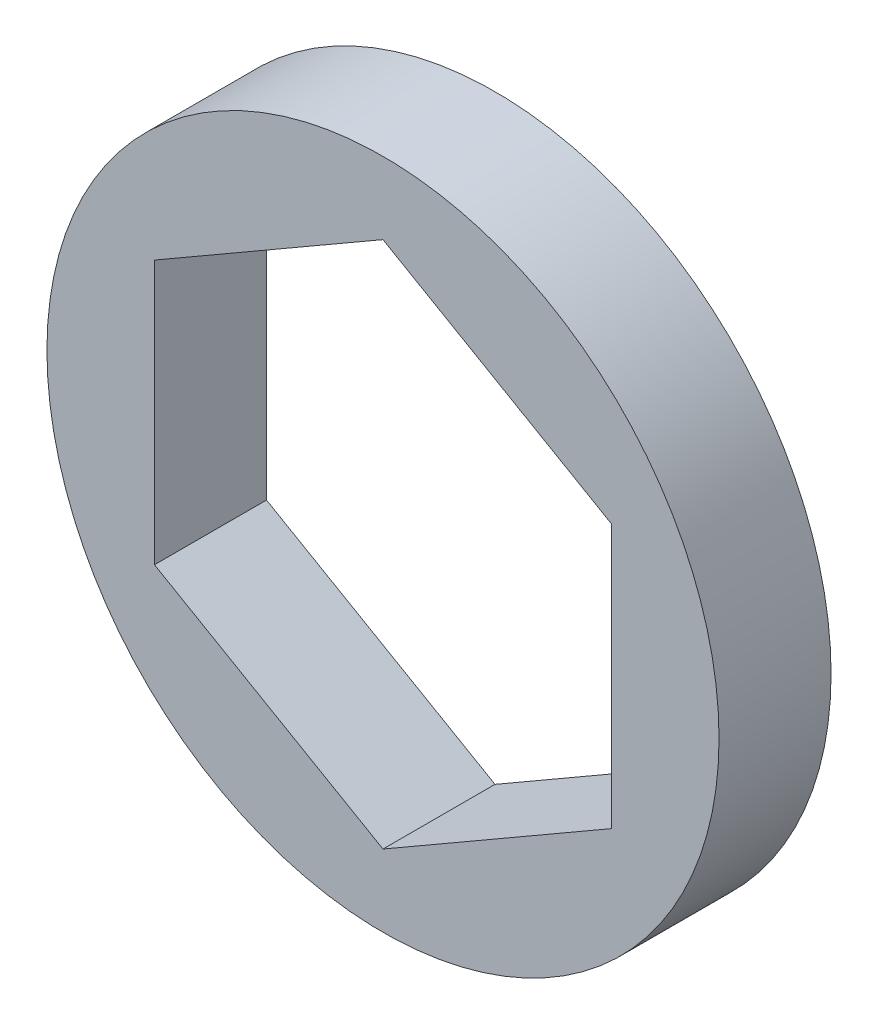
ISO-10303-21;
HEADER;
FILE_DESCRIPTION(('STEP AP214'),'2;1');
FILE_NAME('part.step','',(''),(''),'','','');
FILE_SCHEMA(('AUTOMOTIVE_DESIGN { 1 0 10303 214 1 1 1 1 }'));
ENDSEC;
DATA;
#1=APPLICATION_CONTEXT('core data for automotive mechanical design processes');
#2=APPLICATION_PROTOCOL_DEFINITION('international standard','automotive_design',2000,#1);
#3=PRODUCT_CONTEXT('',#1,'mechanical');
#4=PRODUCT('Part','Part','',(#3));
#5=PRODUCT_RELATED_PRODUCT_CATEGORY('part','',(#4));
#6=PRODUCT_DEFINITION_FORMATION('','',#4);
#7=PRODUCT_DEFINITION_CONTEXT('part definition',#1,'design');
#8=PRODUCT_DEFINITION('design','',#6,#7);
#9=PRODUCT_DEFINITION_SHAPE('','',#8);
#10=(LENGTH_UNIT() NAMED_UNIT(*) SI_UNIT(.MILLI.,.METRE.));
#11=(NAMED_UNIT(*) PLANE_ANGLE_UNIT() SI_UNIT($,.RADIAN.));
#12=(NAMED_UNIT(*) SI_UNIT($,.STERADIAN.) SOLID_ANGLE_UNIT());
#13=UNCERTAINTY_MEASURE_WITH_UNIT(LENGTH_MEASURE(1.E-05),#10,'distance_accuracy_value','');
#14=(GEOMETRIC_REPRESENTATION_CONTEXT(3) GLOBAL_UNCERTAINTY_ASSIGNED_CONTEXT((#13)) GLOBAL_UNIT_ASSIGNED_CONTEXT((#10,
#11,#12)) REPRESENTATION_CONTEXT('',''));
#15=CARTESIAN_POINT('',(0.,0.,0.));
#16=DIRECTION('',(0.,0.,1.));
#17=DIRECTION('',(1.,0.,0.));
#18=AXIS2_PLACEMENT_3D('',#15,#16,#17);
#19=CARTESIAN_POINT('',(0.,0.,-1.5875));
#20=DIRECTION('',(0.,0.,1.));
#21=DIRECTION('',(1.,0.,0.));
#22=AXIS2_PLACEMENT_3D('',#19,#20,#21);
#23=PLANE('',#22);
#24=DIRECTION('',(0.,1.,0.));
#25=VECTOR('',#24,1.);
#26=CARTESIAN_POINT('',(-6.477,3.73949769354121,-1.5875));
#27=LINE('',#26,#25);
#28=CARTESIAN_POINT('',(-6.47700000000001,-3.73949769354121,-1.5875));
#29=VERTEX_POINT('',#28);
#30=CARTESIAN_POINT('',(-6.47700000000001,3.73949769354121,-1.5875));
#31=VERTEX_POINT('',#30);
#32=EDGE_CURVE('E73',#29,#31,#27,.T.);
#33=ORIENTED_EDGE('',*,*,#32,.F.);
#34=DIRECTION('',(-0.866025403784439,0.5,0.));
#35=VECTOR('',#34,1.);
#36=CARTESIAN_POINT('',(-6.47700000000001,-3.73949769354121,-1.5875));
#37=LINE('',#36,#35);
#38=CARTESIAN_POINT('',(0.,-7.47899538708242,-1.5875));
#39=VERTEX_POINT('',#38);
#40=EDGE_CURVE('E104',#39,#29,#37,.T.);
#41=ORIENTED_EDGE('',*,*,#40,.F.);
#42=DIRECTION('',(-0.866025403784439,-0.5,0.));
#43=VECTOR('',#42,1.);
#44=CARTESIAN_POINT('',(0.,-7.47899538708242,-1.5875));
#45=LINE('',#44,#43);
#46=CARTESIAN_POINT('',(6.47700000000001,-3.73949769354122,-1.5875));
#47=VERTEX_POINT('',#46);
#48=EDGE_CURVE('E112',#47,#39,#45,.T.);
#49=ORIENTED_EDGE('',*,*,#48,.F.);
#50=DIRECTION('',(0.,-1.,0.));
#51=VECTOR('',#50,1.);
#52=CARTESIAN_POINT('',(6.47700000000001,-3.73949769354122,-1.5875));
#53=LINE('',#52,#51);
#54=CARTESIAN_POINT('',(6.47700000000001,3.73949769354121,-1.5875));
#55=VERTEX_POINT('',#54);
#56=EDGE_CURVE('E117',#55,#47,#53,.T.);
#57=ORIENTED_EDGE('',*,*,#56,.F.);
#58=DIRECTION('',(0.866025403784438,-0.5,0.));
#59=VECTOR('',#58,1.);
#60=CARTESIAN_POINT('',(6.47700000000001,3.73949769354121,-1.5875));
#61=LINE('',#60,#59);
#62=CARTESIAN_POINT('',(0.,7.47899538708242,-1.5875));
#63=VERTEX_POINT('',#62);
#64=EDGE_CURVE('E68',#63,#55,#61,.T.);
#65=ORIENTED_EDGE('',*,*,#64,.F.);
#66=DIRECTION('',(0.866025403784439,0.5,0.));
#67=VECTOR('',#66,1.);
#68=CARTESIAN_POINT('',(0.,7.47899538708242,-1.5875));
#69=LINE('',#68,#67);
#70=EDGE_CURVE('E70',#31,#63,#69,.T.);
#71=ORIENTED_EDGE('',*,*,#70,.F.);
#72=EDGE_LOOP('',(#33,#41,#49,#57,#65,#71));
#73=FACE_BOUND('',#72,.T.);
#74=CARTESIAN_POINT('',(0.,0.,-1.5875));
#75=DIRECTION('',(0.,0.,-1.));
#76=DIRECTION('',(-1.,0.,0.));
#77=AXIS2_PLACEMENT_3D('',#74,#75,#76);
#78=CIRCLE('',#77,9.525);
#79=CARTESIAN_POINT('',(-9.525,0.,-1.5875));
#80=VERTEX_POINT('',#79);
#81=EDGE_CURVE('E20',#80,#80,#78,.F.);
#82=ORIENTED_EDGE('',*,*,#81,.F.);
#83=EDGE_LOOP('',(#82));
#84=FACE_BOUND('',#83,.T.);
#85=ADVANCED_FACE('F17',(#73,#84),#23,.F.);
#86=CARTESIAN_POINT('',(0.,0.,1.5875));
#87=DIRECTION('',(0.,0.,-1.));
#88=DIRECTION('',(-1.,0.,0.));
#89=AXIS2_PLACEMENT_3D('',#86,#87,#88);
#90=CYLINDRICAL_SURFACE('',#89,9.525);
#91=ORIENTED_EDGE('',*,*,#81,.T.);
#92=EDGE_LOOP('',(#91));
#93=FACE_BOUND('',#92,.T.);
#94=CARTESIAN_POINT('',(0.,0.,1.5875));
#95=DIRECTION('',(0.,0.,-1.));
#96=DIRECTION('',(-1.,0.,0.));
#97=AXIS2_PLACEMENT_3D('',#94,#95,#96);
#98=CIRCLE('',#97,9.525);
#99=CARTESIAN_POINT('',(-9.525,0.,1.5875));
#100=VERTEX_POINT('',#99);
#101=EDGE_CURVE('E96',#100,#100,#98,.F.);
#102=ORIENTED_EDGE('',*,*,#101,.F.);
#103=EDGE_LOOP('',(#102));
#104=FACE_BOUND('',#103,.T.);
#105=ADVANCED_FACE('F155',(#93,#104),#90,.T.);
#106=CARTESIAN_POINT('',(-6.477,3.73949769354121,1.5875));
#107=DIRECTION('',(1.,0.,0.));
#108=DIRECTION('',(0.,1.,0.));
#109=AXIS2_PLACEMENT_3D('',#106,#107,#108);
#110=PLANE('',#109);
#111=DIRECTION('',(0.,1.,0.));
#112=VECTOR('',#111,1.);
#113=CARTESIAN_POINT('',(-6.47700000000001,0.,1.5875));
#114=LINE('',#113,#112);
#115=CARTESIAN_POINT('',(-6.47700000000001,-3.73949769354121,1.5875));
#116=VERTEX_POINT('',#115);
#117=CARTESIAN_POINT('',(-6.477,3.73949769354121,1.5875));
#118=VERTEX_POINT('',#117);
#119=EDGE_CURVE('E98',#116,#118,#114,.T.);
#120=ORIENTED_EDGE('',*,*,#119,.F.);
#121=DIRECTION('',(0.,0.,1.));
#122=VECTOR('',#121,1.);
#123=CARTESIAN_POINT('',(-6.47700000000001,-3.73949769354121,1.5875));
#124=LINE('',#123,#122);
#125=EDGE_CURVE('E84',#29,#116,#124,.T.);
#126=ORIENTED_EDGE('',*,*,#125,.F.);
#127=ORIENTED_EDGE('',*,*,#32,.T.);
#128=DIRECTION('',(0.,0.,1.));
#129=VECTOR('',#128,1.);
#130=CARTESIAN_POINT('',(-6.47700000000001,3.73949769354121,1.5875));
#131=LINE('',#130,#129);
#132=EDGE_CURVE('E78',#118,#31,#131,.F.);
#133=ORIENTED_EDGE('',*,*,#132,.F.);
#134=EDGE_LOOP('',(#120,#126,#127,#133));
#135=FACE_BOUND('',#134,.T.);
#136=ADVANCED_FACE('F81',(#135),#110,.T.);
#137=CARTESIAN_POINT('',(0.,7.47899538708242,1.5875));
#138=DIRECTION('',(0.5,-0.866025403784439,0.));
#139=DIRECTION('',(0.866025403784439,0.5,0.));
#140=AXIS2_PLACEMENT_3D('',#137,#138,#139);
#141=PLANE('',#140);
#142=DIRECTION('',(0.866025403784439,0.499999999999999,0.));
#143=VECTOR('',#142,1.);
#144=CARTESIAN_POINT('',(-6.477,3.73949769354121,1.5875));
#145=LINE('',#144,#143);
#146=CARTESIAN_POINT('',(0.,7.47899538708242,1.5875));
#147=VERTEX_POINT('',#146);
#148=EDGE_CURVE('E89',#118,#147,#145,.T.);
#149=ORIENTED_EDGE('',*,*,#148,.F.);
#150=ORIENTED_EDGE('',*,*,#132,.T.);
#151=ORIENTED_EDGE('',*,*,#70,.T.);
#152=DIRECTION('',(0.,0.,1.));
#153=VECTOR('',#152,1.);
#154=CARTESIAN_POINT('',(0.,7.47899538708242,1.5875));
#155=LINE('',#154,#153);
#156=EDGE_CURVE('E93',#147,#63,#155,.F.);
#157=ORIENTED_EDGE('',*,*,#156,.F.);
#158=EDGE_LOOP('',(#149,#150,#151,#157));
#159=FACE_BOUND('',#158,.T.);
#160=ADVANCED_FACE('F87',(#159),#141,.T.);
#161=CARTESIAN_POINT('',(6.47700000000001,3.73949769354121,1.5875));
#162=DIRECTION('',(-0.5,-0.866025403784438,0.));
#163=DIRECTION('',(0.866025403784438,-0.5,0.));
#164=AXIS2_PLACEMENT_3D('',#161,#162,#163);
#165=PLANE('',#164);
#166=DIRECTION('',(0.866025403784439,-0.5,0.));
#167=VECTOR('',#166,1.);
#168=CARTESIAN_POINT('',(0.,7.47899538708242,1.5875));
#169=LINE('',#168,#167);
#170=CARTESIAN_POINT('',(6.47700000000001,3.73949769354121,1.5875));
#171=VERTEX_POINT('',#170);
#172=EDGE_CURVE('E124',#147,#171,#169,.T.);
#173=ORIENTED_EDGE('',*,*,#172,.F.);
#174=ORIENTED_EDGE('',*,*,#156,.T.);
#175=ORIENTED_EDGE('',*,*,#64,.T.);
#176=DIRECTION('',(0.,0.,1.));
#177=VECTOR('',#176,1.);
#178=CARTESIAN_POINT('',(6.47700000000001,3.73949769354121,1.5875));
#179=LINE('',#178,#177);
#180=EDGE_CURVE('E114',#171,#55,#179,.F.);
#181=ORIENTED_EDGE('',*,*,#180,.F.);
#182=EDGE_LOOP('',(#173,#174,#175,#181));
#183=FACE_BOUND('',#182,.T.);
#184=ADVANCED_FACE('F122',(#183),#165,.T.);
#185=CARTESIAN_POINT('',(6.47700000000001,-3.73949769354122,1.5875));
#186=DIRECTION('',(-1.,0.,0.));
#187=DIRECTION('',(0.,-1.,0.));
#188=AXIS2_PLACEMENT_3D('',#185,#186,#187);
#189=PLANE('',#188);
#190=DIRECTION('',(0.,1.,0.));
#191=VECTOR('',#190,1.);
#192=CARTESIAN_POINT('',(6.47700000000001,0.,1.5875));
#193=LINE('',#192,#191);
#194=CARTESIAN_POINT('',(6.47700000000001,-3.73949769354122,1.5875));
#195=VERTEX_POINT('',#194);
#196=EDGE_CURVE('E128',#171,#195,#193,.F.);
#197=ORIENTED_EDGE('',*,*,#196,.F.);
#198=ORIENTED_EDGE('',*,*,#180,.T.);
#199=ORIENTED_EDGE('',*,*,#56,.T.);
#200=DIRECTION('',(0.,0.,1.));
#201=VECTOR('',#200,1.);
#202=CARTESIAN_POINT('',(6.47700000000001,-3.73949769354122,1.5875));
#203=LINE('',#202,#201);
#204=EDGE_CURVE('E109',#195,#47,#203,.F.);
#205=ORIENTED_EDGE('',*,*,#204,.F.);
#206=EDGE_LOOP('',(#197,#198,#199,#205));
#207=FACE_BOUND('',#206,.T.);
#208=ADVANCED_FACE('F136',(#207),#189,.T.);
#209=CARTESIAN_POINT('',(0.,-7.47899538708242,1.5875));
#210=DIRECTION('',(-0.5,0.866025403784439,0.));
#211=DIRECTION('',(-0.866025403784439,-0.5,0.));
#212=AXIS2_PLACEMENT_3D('',#209,#210,#211);
#213=PLANE('',#212);
#214=DIRECTION('',(-0.866025403784439,-0.5,0.));
#215=VECTOR('',#214,1.);
#216=CARTESIAN_POINT('',(6.47700000000001,-3.73949769354122,1.5875));
#217=LINE('',#216,#215);
#218=CARTESIAN_POINT('',(0.,-7.47899538708242,1.5875));
#219=VERTEX_POINT('',#218);
#220=EDGE_CURVE('E26',#195,#219,#217,.T.);
#221=ORIENTED_EDGE('',*,*,#220,.F.);
#222=ORIENTED_EDGE('',*,*,#204,.T.);
#223=ORIENTED_EDGE('',*,*,#48,.T.);
#224=DIRECTION('',(0.,0.,1.));
#225=VECTOR('',#224,1.);
#226=CARTESIAN_POINT('',(0.,-7.47899538708242,1.5875));
#227=LINE('',#226,#225);
#228=EDGE_CURVE('E35',#219,#39,#227,.F.);
#229=ORIENTED_EDGE('',*,*,#228,.F.);
#230=EDGE_LOOP('',(#221,#222,#223,#229));
#231=FACE_BOUND('',#230,.T.);
#232=ADVANCED_FACE('F134',(#231),#213,.T.);
#233=CARTESIAN_POINT('',(-6.47700000000001,-3.73949769354121,1.5875));
#234=DIRECTION('',(0.5,0.866025403784439,0.));
#235=DIRECTION('',(-0.866025403784439,0.5,0.));
#236=AXIS2_PLACEMENT_3D('',#233,#234,#235);
#237=PLANE('',#236);
#238=DIRECTION('',(-0.866025403784439,0.5,0.));
#239=VECTOR('',#238,1.);
#240=CARTESIAN_POINT('',(0.,-7.47899538708242,1.5875));
#241=LINE('',#240,#239);
#242=EDGE_CURVE('E10',#219,#116,#241,.T.);
#243=ORIENTED_EDGE('',*,*,#242,.F.);
#244=ORIENTED_EDGE('',*,*,#228,.T.);
#245=ORIENTED_EDGE('',*,*,#40,.T.);
#246=ORIENTED_EDGE('',*,*,#125,.T.);
#247=EDGE_LOOP('',(#243,#244,#245,#246));
#248=FACE_BOUND('',#247,.T.);
#249=ADVANCED_FACE('F137',(#248),#237,.T.);
#250=CARTESIAN_POINT('',(0.,0.,1.5875));
#251=DIRECTION('',(0.,0.,1.));
#252=DIRECTION('',(1.,0.,0.));
#253=AXIS2_PLACEMENT_3D('',#250,#251,#252);
#254=PLANE('',#253);
#255=ORIENTED_EDGE('',*,*,#220,.T.);
#256=ORIENTED_EDGE('',*,*,#242,.T.);
#257=ORIENTED_EDGE('',*,*,#119,.T.);
#258=ORIENTED_EDGE('',*,*,#148,.T.);
#259=ORIENTED_EDGE('',*,*,#172,.T.);
#260=ORIENTED_EDGE('',*,*,#196,.T.);
#261=EDGE_LOOP('',(#255,#256,#257,#258,#259,#260));
#262=FACE_BOUND('',#261,.T.);
#263=ORIENTED_EDGE('',*,*,#101,.T.);
#264=EDGE_LOOP('',(#263));
#265=FACE_BOUND('',#264,.T.);
#266=ADVANCED_FACE('F131',(#262,#265),#254,.T.);
#267=CLOSED_SHELL('',(#85,#105,#136,#160,#184,#208,#232,#249,#266));
#268=MANIFOLD_SOLID_BREP('B1',#267);
#269=ADVANCED_BREP_SHAPE_REPRESENTATION('',(#18,#268),#14);
#270=SHAPE_DEFINITION_REPRESENTATION(#9,#269);
ENDSEC;
END-ISO-10303-21;
